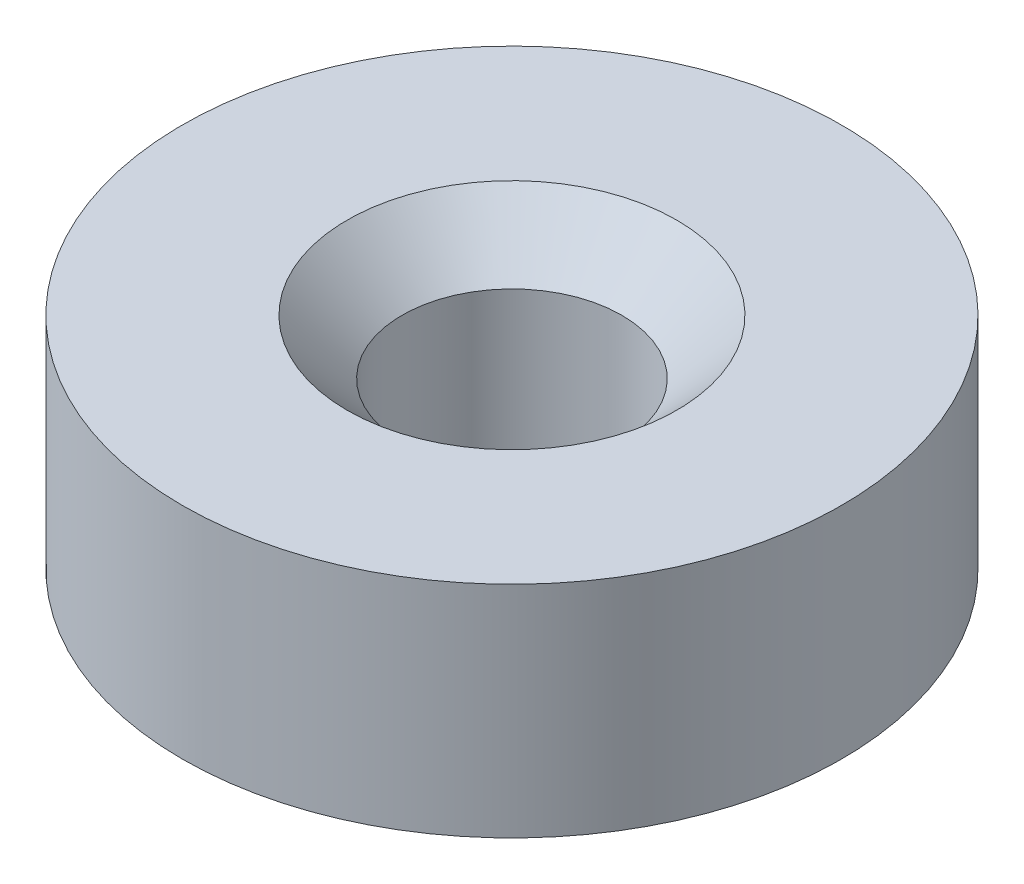
ISO-10303-21;
HEADER;
FILE_DESCRIPTION(('STEP AP214'),'2;1');
FILE_NAME('part.step','',(''),(''),'','','');
FILE_SCHEMA(('AUTOMOTIVE_DESIGN { 1 0 10303 214 1 1 1 1 }'));
ENDSEC;
DATA;
#1=APPLICATION_CONTEXT('core data for automotive mechanical design processes');
#2=APPLICATION_PROTOCOL_DEFINITION('international standard','automotive_design',2000,#1);
#3=PRODUCT_CONTEXT('',#1,'mechanical');
#4=PRODUCT('Part','Part','',(#3));
#5=PRODUCT_RELATED_PRODUCT_CATEGORY('part','',(#4));
#6=PRODUCT_DEFINITION_FORMATION('','',#4);
#7=PRODUCT_DEFINITION_CONTEXT('part definition',#1,'design');
#8=PRODUCT_DEFINITION('design','',#6,#7);
#9=PRODUCT_DEFINITION_SHAPE('','',#8);
#10=(LENGTH_UNIT() NAMED_UNIT(*) SI_UNIT(.MILLI.,.METRE.));
#11=(NAMED_UNIT(*) PLANE_ANGLE_UNIT() SI_UNIT($,.RADIAN.));
#12=(NAMED_UNIT(*) SI_UNIT($,.STERADIAN.) SOLID_ANGLE_UNIT());
#13=UNCERTAINTY_MEASURE_WITH_UNIT(LENGTH_MEASURE(1.E-05),#10,'distance_accuracy_value','');
#14=(GEOMETRIC_REPRESENTATION_CONTEXT(3) GLOBAL_UNCERTAINTY_ASSIGNED_CONTEXT((#13)) GLOBAL_UNIT_ASSIGNED_CONTEXT((#10,
#11,#12)) REPRESENTATION_CONTEXT('',''));
#15=CARTESIAN_POINT('',(0.,0.,0.));
#16=DIRECTION('',(0.,0.,1.));
#17=DIRECTION('',(1.,0.,0.));
#18=AXIS2_PLACEMENT_3D('',#15,#16,#17);
#19=CARTESIAN_POINT('',(0.,4.,0.));
#20=DIRECTION('',(0.,1.,0.));
#21=DIRECTION('',(0.,0.,1.));
#22=AXIS2_PLACEMENT_3D('',#19,#20,#21);
#23=PLANE('',#22);
#24=CARTESIAN_POINT('',(0.,4.,0.));
#25=DIRECTION('',(0.,1.,0.));
#26=DIRECTION('',(0.,0.,1.));
#27=AXIS2_PLACEMENT_3D('',#24,#25,#26);
#28=CIRCLE('',#27,3.00000000000001);
#29=CARTESIAN_POINT('',(0.,4.,3.00000000000001));
#30=VERTEX_POINT('',#29);
#31=EDGE_CURVE('E10',#30,#30,#28,.F.);
#32=ORIENTED_EDGE('',*,*,#31,.T.);
#33=EDGE_LOOP('',(#32));
#34=FACE_BOUND('',#33,.T.);
#35=CARTESIAN_POINT('',(0.,4.,0.));
#36=DIRECTION('',(0.,1.,0.));
#37=DIRECTION('',(0.,0.,1.));
#38=AXIS2_PLACEMENT_3D('',#35,#36,#37);
#39=CIRCLE('',#38,6.);
#40=CARTESIAN_POINT('',(0.,4.,6.));
#41=VERTEX_POINT('',#40);
#42=EDGE_CURVE('E42',#41,#41,#39,.T.);
#43=ORIENTED_EDGE('',*,*,#42,.T.);
#44=EDGE_LOOP('',(#43));
#45=FACE_BOUND('',#44,.T.);
#46=ADVANCED_FACE('F31',(#34,#45),#23,.T.);
#47=CARTESIAN_POINT('',(0.,0.,0.));
#48=DIRECTION('',(0.,1.,0.));
#49=DIRECTION('',(0.,0.,1.));
#50=AXIS2_PLACEMENT_3D('',#47,#48,#49);
#51=PLANE('',#50);
#52=CARTESIAN_POINT('',(0.,0.,0.));
#53=DIRECTION('',(0.,1.,0.));
#54=DIRECTION('',(0.,0.,1.));
#55=AXIS2_PLACEMENT_3D('',#52,#53,#54);
#56=CIRCLE('',#55,6.);
#57=CARTESIAN_POINT('',(0.,0.,6.));
#58=VERTEX_POINT('',#57);
#59=EDGE_CURVE('E46',#58,#58,#56,.T.);
#60=ORIENTED_EDGE('',*,*,#59,.F.);
#61=EDGE_LOOP('',(#60));
#62=FACE_BOUND('',#61,.T.);
#63=CARTESIAN_POINT('',(0.,0.,0.));
#64=DIRECTION('',(0.,1.,0.));
#65=DIRECTION('',(0.,0.,1.));
#66=AXIS2_PLACEMENT_3D('',#63,#64,#65);
#67=CIRCLE('',#66,2.);
#68=CARTESIAN_POINT('',(0.,0.,2.));
#69=VERTEX_POINT('',#68);
#70=EDGE_CURVE('E50',#69,#69,#67,.T.);
#71=ORIENTED_EDGE('',*,*,#70,.T.);
#72=EDGE_LOOP('',(#71));
#73=FACE_BOUND('',#72,.T.);
#74=ADVANCED_FACE('F55',(#62,#73),#51,.F.);
#75=CARTESIAN_POINT('',(0.,4.,0.));
#76=DIRECTION('',(0.,-1.,0.));
#77=DIRECTION('',(0.,0.,-1.));
#78=AXIS2_PLACEMENT_3D('',#75,#76,#77);
#79=CYLINDRICAL_SURFACE('',#78,6.);
#80=ORIENTED_EDGE('',*,*,#42,.F.);
#81=EDGE_LOOP('',(#80));
#82=FACE_BOUND('',#81,.T.);
#83=ORIENTED_EDGE('',*,*,#59,.T.);
#84=EDGE_LOOP('',(#83));
#85=FACE_BOUND('',#84,.T.);
#86=ADVANCED_FACE('F59',(#82,#85),#79,.T.);
#87=CARTESIAN_POINT('',(0.,4.,0.));
#88=DIRECTION('',(0.,-1.,0.));
#89=DIRECTION('',(0.,0.,-1.));
#90=AXIS2_PLACEMENT_3D('',#87,#88,#89);
#91=CYLINDRICAL_SURFACE('',#90,2.);
#92=CARTESIAN_POINT('',(0.,2.99999999999999,0.));
#93=DIRECTION('',(0.,1.,0.));
#94=DIRECTION('',(0.,0.,1.));
#95=AXIS2_PLACEMENT_3D('',#92,#93,#94);
#96=CIRCLE('',#95,2.);
#97=CARTESIAN_POINT('',(0.,2.99999999999999,2.));
#98=VERTEX_POINT('',#97);
#99=EDGE_CURVE('E38',#98,#98,#96,.T.);
#100=ORIENTED_EDGE('',*,*,#99,.T.);
#101=EDGE_LOOP('',(#100));
#102=FACE_BOUND('',#101,.T.);
#103=ORIENTED_EDGE('',*,*,#70,.F.);
#104=EDGE_LOOP('',(#103));
#105=FACE_BOUND('',#104,.T.);
#106=ADVANCED_FACE('F57',(#102,#105),#91,.F.);
#107=CARTESIAN_POINT('',(0.,2.99999999999999,0.));
#108=DIRECTION('',(0.,1.,0.));
#109=DIRECTION('',(0.,0.,1.));
#110=AXIS2_PLACEMENT_3D('',#107,#108,#109);
#111=CONICAL_SURFACE('',#110,2.,0.78539816339745);
#112=ORIENTED_EDGE('',*,*,#31,.F.);
#113=EDGE_LOOP('',(#112));
#114=FACE_BOUND('',#113,.T.);
#115=ORIENTED_EDGE('',*,*,#99,.F.);
#116=EDGE_LOOP('',(#115));
#117=FACE_BOUND('',#116,.T.);
#118=ADVANCED_FACE('F33',(#114,#117),#111,.F.);
#119=CLOSED_SHELL('',(#46,#74,#86,#106,#118));
#120=MANIFOLD_SOLID_BREP('B2',#119);
#121=ADVANCED_BREP_SHAPE_REPRESENTATION('',(#18,#120),#14);
#122=SHAPE_DEFINITION_REPRESENTATION(#9,#121);
ENDSEC;
END-ISO-10303-21;
